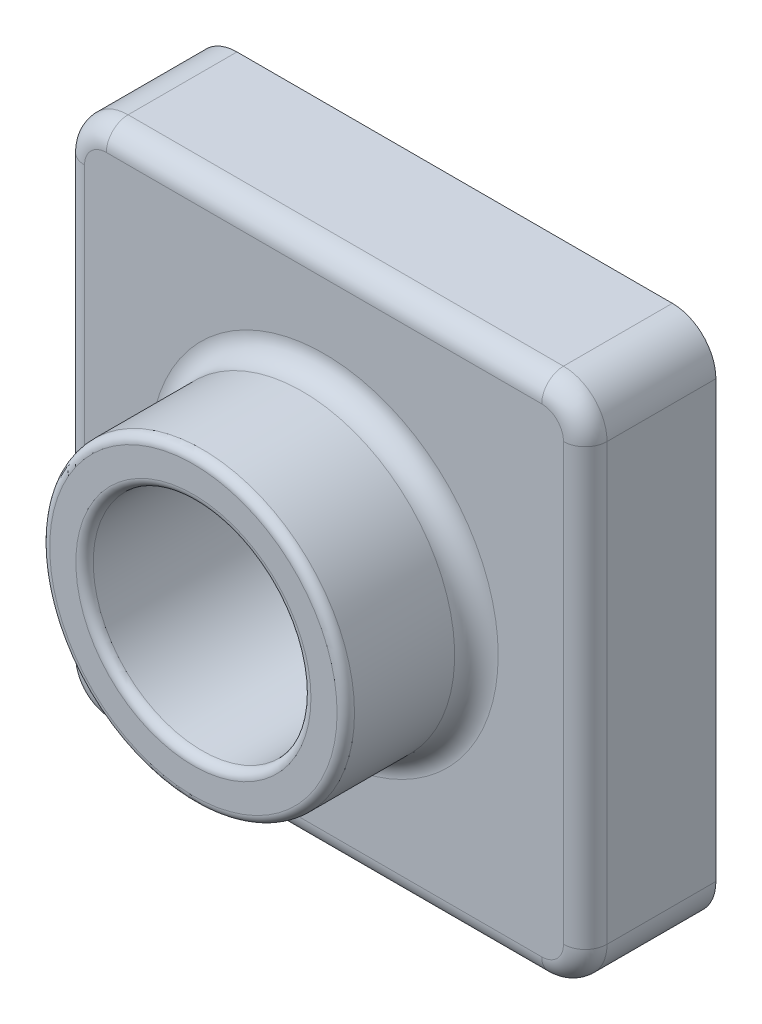
ISO-10303-21;
HEADER;
FILE_DESCRIPTION(('STEP AP214'),'2;1');
FILE_NAME('part.step','',(''),(''),'','','');
FILE_SCHEMA(('AUTOMOTIVE_DESIGN { 1 0 10303 214 1 1 1 1 }'));
ENDSEC;
DATA;
#1=APPLICATION_CONTEXT('core data for automotive mechanical design processes');
#2=APPLICATION_PROTOCOL_DEFINITION('international standard','automotive_design',2000,#1);
#3=PRODUCT_CONTEXT('',#1,'mechanical');
#4=PRODUCT('Part','Part','',(#3));
#5=PRODUCT_RELATED_PRODUCT_CATEGORY('part','',(#4));
#6=PRODUCT_DEFINITION_FORMATION('','',#4);
#7=PRODUCT_DEFINITION_CONTEXT('part definition',#1,'design');
#8=PRODUCT_DEFINITION('design','',#6,#7);
#9=PRODUCT_DEFINITION_SHAPE('','',#8);
#10=(LENGTH_UNIT() NAMED_UNIT(*) SI_UNIT(.MILLI.,.METRE.));
#11=(NAMED_UNIT(*) PLANE_ANGLE_UNIT() SI_UNIT($,.RADIAN.));
#12=(NAMED_UNIT(*) SI_UNIT($,.STERADIAN.) SOLID_ANGLE_UNIT());
#13=UNCERTAINTY_MEASURE_WITH_UNIT(LENGTH_MEASURE(1.E-05),#10,'distance_accuracy_value','');
#14=(GEOMETRIC_REPRESENTATION_CONTEXT(3) GLOBAL_UNCERTAINTY_ASSIGNED_CONTEXT((#13)) GLOBAL_UNIT_ASSIGNED_CONTEXT((#10,
#11,#12)) REPRESENTATION_CONTEXT('',''));
#15=CARTESIAN_POINT('',(0.,0.,0.));
#16=DIRECTION('',(0.,0.,1.));
#17=DIRECTION('',(1.,0.,0.));
#18=AXIS2_PLACEMENT_3D('',#15,#16,#17);
#19=CARTESIAN_POINT('',(0.,120.,0.));
#20=DIRECTION('',(0.,0.,-1.));
#21=DIRECTION('',(-1.,0.,0.));
#22=AXIS2_PLACEMENT_3D('',#19,#20,#21);
#23=PLANE('',#22);
#24=DIRECTION('',(0.,1.,0.));
#25=VECTOR('',#24,1.);
#26=CARTESIAN_POINT('',(120.,0.,0.));
#27=LINE('',#26,#25);
#28=CARTESIAN_POINT('',(120.,10.,0.));
#29=VERTEX_POINT('',#28);
#30=CARTESIAN_POINT('',(120.,110.,0.));
#31=VERTEX_POINT('',#30);
#32=EDGE_CURVE('E330',#29,#31,#27,.T.);
#33=ORIENTED_EDGE('',*,*,#32,.F.);
#34=CARTESIAN_POINT('',(110.,10.,0.));
#35=DIRECTION('',(0.,0.,-1.));
#36=DIRECTION('',(-1.,0.,0.));
#37=AXIS2_PLACEMENT_3D('',#34,#35,#36);
#38=CIRCLE('',#37,10.);
#39=CARTESIAN_POINT('',(110.,0.,0.));
#40=VERTEX_POINT('',#39);
#41=EDGE_CURVE('E359',#29,#40,#38,.T.);
#42=ORIENTED_EDGE('',*,*,#41,.T.);
#43=DIRECTION('',(1.,0.,0.));
#44=VECTOR('',#43,1.);
#45=CARTESIAN_POINT('',(0.,0.,0.));
#46=LINE('',#45,#44);
#47=CARTESIAN_POINT('',(10.,0.,0.));
#48=VERTEX_POINT('',#47);
#49=EDGE_CURVE('E327',#48,#40,#46,.T.);
#50=ORIENTED_EDGE('',*,*,#49,.F.);
#51=CARTESIAN_POINT('',(10.,10.,0.));
#52=DIRECTION('',(0.,0.,-1.));
#53=DIRECTION('',(-1.,0.,0.));
#54=AXIS2_PLACEMENT_3D('',#51,#52,#53);
#55=CIRCLE('',#54,10.);
#56=CARTESIAN_POINT('',(0.,10.,0.));
#57=VERTEX_POINT('',#56);
#58=EDGE_CURVE('E357',#48,#57,#55,.T.);
#59=ORIENTED_EDGE('',*,*,#58,.T.);
#60=DIRECTION('',(0.,-1.,0.));
#61=VECTOR('',#60,1.);
#62=CARTESIAN_POINT('',(0.,0.,0.));
#63=LINE('',#62,#61);
#64=CARTESIAN_POINT('',(0.,110.,0.));
#65=VERTEX_POINT('',#64);
#66=EDGE_CURVE('E324',#65,#57,#63,.T.);
#67=ORIENTED_EDGE('',*,*,#66,.F.);
#68=CARTESIAN_POINT('',(10.,110.,0.));
#69=DIRECTION('',(0.,0.,-1.));
#70=DIRECTION('',(-1.,0.,0.));
#71=AXIS2_PLACEMENT_3D('',#68,#69,#70);
#72=CIRCLE('',#71,10.);
#73=CARTESIAN_POINT('',(10.,120.,0.));
#74=VERTEX_POINT('',#73);
#75=EDGE_CURVE('E355',#65,#74,#72,.T.);
#76=ORIENTED_EDGE('',*,*,#75,.T.);
#77=DIRECTION('',(-1.,0.,0.));
#78=VECTOR('',#77,1.);
#79=CARTESIAN_POINT('',(0.,120.,0.));
#80=LINE('',#79,#78);
#81=CARTESIAN_POINT('',(110.,120.,0.));
#82=VERTEX_POINT('',#81);
#83=EDGE_CURVE('E333',#82,#74,#80,.T.);
#84=ORIENTED_EDGE('',*,*,#83,.F.);
#85=CARTESIAN_POINT('',(110.,110.,0.));
#86=DIRECTION('',(0.,0.,-1.));
#87=DIRECTION('',(-1.,0.,0.));
#88=AXIS2_PLACEMENT_3D('',#85,#86,#87);
#89=CIRCLE('',#88,10.);
#90=EDGE_CURVE('E353',#82,#31,#89,.T.);
#91=ORIENTED_EDGE('',*,*,#90,.T.);
#92=EDGE_LOOP('',(#33,#42,#50,#59,#67,#76,#84,#91));
#93=FACE_BOUND('',#92,.T.);
#94=CARTESIAN_POINT('',(110.,10.,0.));
#95=DIRECTION('',(0.,0.,-1.));
#96=DIRECTION('',(-1.,0.,0.));
#97=AXIS2_PLACEMENT_3D('',#94,#95,#96);
#98=CIRCLE('',#97,8.);
#99=CARTESIAN_POINT('',(118.,10.,0.));
#100=VERTEX_POINT('',#99);
#101=CARTESIAN_POINT('',(110.,2.,0.));
#102=VERTEX_POINT('',#101);
#103=EDGE_CURVE('E280',#100,#102,#98,.T.);
#104=ORIENTED_EDGE('',*,*,#103,.F.);
#105=DIRECTION('',(0.,1.,0.));
#106=VECTOR('',#105,1.);
#107=CARTESIAN_POINT('',(118.,120.,0.));
#108=LINE('',#107,#106);
#109=CARTESIAN_POINT('',(118.,110.,0.));
#110=VERTEX_POINT('',#109);
#111=EDGE_CURVE('E306',#100,#110,#108,.T.);
#112=ORIENTED_EDGE('',*,*,#111,.T.);
#113=CARTESIAN_POINT('',(110.,110.,0.));
#114=DIRECTION('',(0.,0.,-1.));
#115=DIRECTION('',(-1.,0.,0.));
#116=AXIS2_PLACEMENT_3D('',#113,#114,#115);
#117=CIRCLE('',#116,8.);
#118=CARTESIAN_POINT('',(110.,118.,0.));
#119=VERTEX_POINT('',#118);
#120=EDGE_CURVE('E269',#119,#110,#117,.T.);
#121=ORIENTED_EDGE('',*,*,#120,.F.);
#122=DIRECTION('',(-1.,0.,0.));
#123=VECTOR('',#122,1.);
#124=CARTESIAN_POINT('',(0.,118.,0.));
#125=LINE('',#124,#123);
#126=CARTESIAN_POINT('',(10.,118.,0.));
#127=VERTEX_POINT('',#126);
#128=EDGE_CURVE('E49',#119,#127,#125,.T.);
#129=ORIENTED_EDGE('',*,*,#128,.T.);
#130=CARTESIAN_POINT('',(10.,110.,0.));
#131=DIRECTION('',(0.,0.,-1.));
#132=DIRECTION('',(-1.,0.,0.));
#133=AXIS2_PLACEMENT_3D('',#130,#131,#132);
#134=CIRCLE('',#133,8.);
#135=CARTESIAN_POINT('',(2.,110.,0.));
#136=VERTEX_POINT('',#135);
#137=EDGE_CURVE('E315',#136,#127,#134,.T.);
#138=ORIENTED_EDGE('',*,*,#137,.F.);
#139=DIRECTION('',(0.,-1.,0.));
#140=VECTOR('',#139,1.);
#141=CARTESIAN_POINT('',(2.,120.,0.));
#142=LINE('',#141,#140);
#143=CARTESIAN_POINT('',(2.,10.,0.));
#144=VERTEX_POINT('',#143);
#145=EDGE_CURVE('E305',#136,#144,#142,.T.);
#146=ORIENTED_EDGE('',*,*,#145,.T.);
#147=CARTESIAN_POINT('',(10.,10.,0.));
#148=DIRECTION('',(0.,0.,-1.));
#149=DIRECTION('',(-1.,0.,0.));
#150=AXIS2_PLACEMENT_3D('',#147,#148,#149);
#151=CIRCLE('',#150,8.);
#152=CARTESIAN_POINT('',(9.99999999999999,2.,0.));
#153=VERTEX_POINT('',#152);
#154=EDGE_CURVE('E311',#153,#144,#151,.T.);
#155=ORIENTED_EDGE('',*,*,#154,.F.);
#156=DIRECTION('',(1.,0.,0.));
#157=VECTOR('',#156,1.);
#158=CARTESIAN_POINT('',(0.,2.,0.));
#159=LINE('',#158,#157);
#160=EDGE_CURVE('E309',#153,#102,#159,.T.);
#161=ORIENTED_EDGE('',*,*,#160,.T.);
#162=EDGE_LOOP('',(#104,#112,#121,#129,#138,#146,#155,#161));
#163=FACE_BOUND('',#162,.T.);
#164=ADVANCED_FACE('F32',(#93,#163),#23,.T.);
#165=CARTESIAN_POINT('',(0.,120.,30.));
#166=DIRECTION('',(0.,0.,-1.));
#167=DIRECTION('',(-1.,0.,0.));
#168=AXIS2_PLACEMENT_3D('',#165,#166,#167);
#169=PLANE('',#168);
#170=CARTESIAN_POINT('',(60.,60.,30.));
#171=DIRECTION('',(0.,0.,-1.));
#172=DIRECTION('',(-1.,0.,0.));
#173=AXIS2_PLACEMENT_3D('',#170,#171,#172);
#174=CIRCLE('',#173,40.);
#175=CARTESIAN_POINT('',(20.,60.,30.));
#176=VERTEX_POINT('',#175);
#177=EDGE_CURVE('E395',#176,#176,#174,.T.);
#178=ORIENTED_EDGE('',*,*,#177,.T.);
#179=EDGE_LOOP('',(#178));
#180=FACE_BOUND('',#179,.T.);
#181=DIRECTION('',(0.,-1.,0.));
#182=VECTOR('',#181,1.);
#183=CARTESIAN_POINT('',(5.,120.,30.));
#184=LINE('',#183,#182);
#185=CARTESIAN_POINT('',(5.,110.,30.));
#186=VERTEX_POINT('',#185);
#187=CARTESIAN_POINT('',(5.,10.,30.));
#188=VERTEX_POINT('',#187);
#189=EDGE_CURVE('E390',#186,#188,#184,.T.);
#190=ORIENTED_EDGE('',*,*,#189,.T.);
#191=CARTESIAN_POINT('',(10.,10.,30.));
#192=DIRECTION('',(0.,0.,-1.));
#193=DIRECTION('',(-1.,0.,0.));
#194=AXIS2_PLACEMENT_3D('',#191,#192,#193);
#195=CIRCLE('',#194,5.);
#196=CARTESIAN_POINT('',(10.,5.,30.));
#197=VERTEX_POINT('',#196);
#198=EDGE_CURVE('E392',#188,#197,#195,.F.);
#199=ORIENTED_EDGE('',*,*,#198,.T.);
#200=DIRECTION('',(1.,0.,0.));
#201=VECTOR('',#200,1.);
#202=CARTESIAN_POINT('',(0.,5.,30.));
#203=LINE('',#202,#201);
#204=CARTESIAN_POINT('',(110.,5.,30.));
#205=VERTEX_POINT('',#204);
#206=EDGE_CURVE('E378',#197,#205,#203,.T.);
#207=ORIENTED_EDGE('',*,*,#206,.T.);
#208=CARTESIAN_POINT('',(110.,10.,30.));
#209=DIRECTION('',(0.,0.,-1.));
#210=DIRECTION('',(-1.,0.,0.));
#211=AXIS2_PLACEMENT_3D('',#208,#209,#210);
#212=CIRCLE('',#211,5.);
#213=CARTESIAN_POINT('',(115.,10.,30.));
#214=VERTEX_POINT('',#213);
#215=EDGE_CURVE('E380',#205,#214,#212,.F.);
#216=ORIENTED_EDGE('',*,*,#215,.T.);
#217=DIRECTION('',(0.,1.,0.));
#218=VECTOR('',#217,1.);
#219=CARTESIAN_POINT('',(115.,120.,30.));
#220=LINE('',#219,#218);
#221=CARTESIAN_POINT('',(115.,110.,30.));
#222=VERTEX_POINT('',#221);
#223=EDGE_CURVE('E382',#214,#222,#220,.T.);
#224=ORIENTED_EDGE('',*,*,#223,.T.);
#225=CARTESIAN_POINT('',(110.,110.,30.));
#226=DIRECTION('',(0.,0.,-1.));
#227=DIRECTION('',(-1.,0.,0.));
#228=AXIS2_PLACEMENT_3D('',#225,#226,#227);
#229=CIRCLE('',#228,5.);
#230=CARTESIAN_POINT('',(110.,115.,30.));
#231=VERTEX_POINT('',#230);
#232=EDGE_CURVE('E384',#222,#231,#229,.F.);
#233=ORIENTED_EDGE('',*,*,#232,.T.);
#234=DIRECTION('',(-1.,0.,0.));
#235=VECTOR('',#234,1.);
#236=CARTESIAN_POINT('',(0.,115.,30.));
#237=LINE('',#236,#235);
#238=CARTESIAN_POINT('',(10.,115.,30.));
#239=VERTEX_POINT('',#238);
#240=EDGE_CURVE('E386',#231,#239,#237,.T.);
#241=ORIENTED_EDGE('',*,*,#240,.T.);
#242=CARTESIAN_POINT('',(10.,110.,30.));
#243=DIRECTION('',(0.,0.,-1.));
#244=DIRECTION('',(-1.,0.,0.));
#245=AXIS2_PLACEMENT_3D('',#242,#243,#244);
#246=CIRCLE('',#245,5.);
#247=EDGE_CURVE('E388',#239,#186,#246,.F.);
#248=ORIENTED_EDGE('',*,*,#247,.T.);
#249=EDGE_LOOP('',(#190,#199,#207,#216,#224,#233,#241,#248));
#250=FACE_BOUND('',#249,.T.);
#251=ADVANCED_FACE('F475',(#180,#250),#169,.F.);
#252=CARTESIAN_POINT('',(0.,0.,30.));
#253=DIRECTION('',(1.,0.,0.));
#254=DIRECTION('',(0.,0.,-1.));
#255=AXIS2_PLACEMENT_3D('',#252,#253,#254);
#256=PLANE('',#255);
#257=DIRECTION('',(0.,0.,-1.));
#258=VECTOR('',#257,1.);
#259=CARTESIAN_POINT('',(0.,10.,30.));
#260=LINE('',#259,#258);
#261=CARTESIAN_POINT('',(0.,10.,25.));
#262=VERTEX_POINT('',#261);
#263=EDGE_CURVE('E367',#57,#262,#260,.F.);
#264=ORIENTED_EDGE('',*,*,#263,.T.);
#265=DIRECTION('',(0.,-1.,0.));
#266=VECTOR('',#265,1.);
#267=CARTESIAN_POINT('',(0.,0.,25.));
#268=LINE('',#267,#266);
#269=CARTESIAN_POINT('',(0.,110.,25.));
#270=VERTEX_POINT('',#269);
#271=EDGE_CURVE('E401',#262,#270,#268,.F.);
#272=ORIENTED_EDGE('',*,*,#271,.T.);
#273=DIRECTION('',(0.,0.,-1.));
#274=VECTOR('',#273,1.);
#275=CARTESIAN_POINT('',(0.,110.,30.));
#276=LINE('',#275,#274);
#277=EDGE_CURVE('E365',#270,#65,#276,.T.);
#278=ORIENTED_EDGE('',*,*,#277,.T.);
#279=ORIENTED_EDGE('',*,*,#66,.T.);
#280=EDGE_LOOP('',(#264,#272,#278,#279));
#281=FACE_BOUND('',#280,.T.);
#282=ADVANCED_FACE('F514',(#281),#256,.F.);
#283=CARTESIAN_POINT('',(0.,0.,30.));
#284=DIRECTION('',(0.,1.,0.));
#285=DIRECTION('',(0.,0.,1.));
#286=AXIS2_PLACEMENT_3D('',#283,#284,#285);
#287=PLANE('',#286);
#288=DIRECTION('',(0.,0.,-1.));
#289=VECTOR('',#288,1.);
#290=CARTESIAN_POINT('',(110.,0.,30.));
#291=LINE('',#290,#289);
#292=CARTESIAN_POINT('',(110.,0.,25.));
#293=VERTEX_POINT('',#292);
#294=EDGE_CURVE('E363',#40,#293,#291,.F.);
#295=ORIENTED_EDGE('',*,*,#294,.T.);
#296=DIRECTION('',(1.,0.,0.));
#297=VECTOR('',#296,1.);
#298=CARTESIAN_POINT('',(0.,0.,25.));
#299=LINE('',#298,#297);
#300=CARTESIAN_POINT('',(10.,0.,25.));
#301=VERTEX_POINT('',#300);
#302=EDGE_CURVE('E11',#293,#301,#299,.F.);
#303=ORIENTED_EDGE('',*,*,#302,.T.);
#304=DIRECTION('',(0.,0.,-1.));
#305=VECTOR('',#304,1.);
#306=CARTESIAN_POINT('',(10.,0.,30.));
#307=LINE('',#306,#305);
#308=EDGE_CURVE('E361',#301,#48,#307,.T.);
#309=ORIENTED_EDGE('',*,*,#308,.T.);
#310=ORIENTED_EDGE('',*,*,#49,.T.);
#311=EDGE_LOOP('',(#295,#303,#309,#310));
#312=FACE_BOUND('',#311,.T.);
#313=ADVANCED_FACE('F489',(#312),#287,.F.);
#314=CARTESIAN_POINT('',(120.,0.,30.));
#315=DIRECTION('',(-1.,0.,0.));
#316=DIRECTION('',(0.,-1.,0.));
#317=AXIS2_PLACEMENT_3D('',#314,#315,#316);
#318=PLANE('',#317);
#319=DIRECTION('',(0.,0.,-1.));
#320=VECTOR('',#319,1.);
#321=CARTESIAN_POINT('',(120.,110.,30.));
#322=LINE('',#321,#320);
#323=CARTESIAN_POINT('',(120.,110.,25.));
#324=VERTEX_POINT('',#323);
#325=EDGE_CURVE('E348',#31,#324,#322,.F.);
#326=ORIENTED_EDGE('',*,*,#325,.T.);
#327=DIRECTION('',(0.,1.,0.));
#328=VECTOR('',#327,1.);
#329=CARTESIAN_POINT('',(120.,0.,25.));
#330=LINE('',#329,#328);
#331=CARTESIAN_POINT('',(120.,10.,25.));
#332=VERTEX_POINT('',#331);
#333=EDGE_CURVE('E409',#324,#332,#330,.F.);
#334=ORIENTED_EDGE('',*,*,#333,.T.);
#335=DIRECTION('',(0.,0.,-1.));
#336=VECTOR('',#335,1.);
#337=CARTESIAN_POINT('',(120.,10.,30.));
#338=LINE('',#337,#336);
#339=EDGE_CURVE('E351',#332,#29,#338,.T.);
#340=ORIENTED_EDGE('',*,*,#339,.T.);
#341=ORIENTED_EDGE('',*,*,#32,.T.);
#342=EDGE_LOOP('',(#326,#334,#340,#341));
#343=FACE_BOUND('',#342,.T.);
#344=ADVANCED_FACE('F448',(#343),#318,.F.);
#345=CARTESIAN_POINT('',(0.,120.,30.));
#346=DIRECTION('',(0.,-1.,0.));
#347=DIRECTION('',(0.,0.,-1.));
#348=AXIS2_PLACEMENT_3D('',#345,#346,#347);
#349=PLANE('',#348);
#350=DIRECTION('',(0.,0.,-1.));
#351=VECTOR('',#350,1.);
#352=CARTESIAN_POINT('',(10.,120.,30.));
#353=LINE('',#352,#351);
#354=CARTESIAN_POINT('',(10.,120.,25.));
#355=VERTEX_POINT('',#354);
#356=EDGE_CURVE('E372',#74,#355,#353,.F.);
#357=ORIENTED_EDGE('',*,*,#356,.T.);
#358=DIRECTION('',(-1.,0.,0.));
#359=VECTOR('',#358,1.);
#360=CARTESIAN_POINT('',(0.,120.,25.));
#361=LINE('',#360,#359);
#362=CARTESIAN_POINT('',(110.,120.,25.));
#363=VERTEX_POINT('',#362);
#364=EDGE_CURVE('E405',#355,#363,#361,.F.);
#365=ORIENTED_EDGE('',*,*,#364,.T.);
#366=DIRECTION('',(0.,0.,-1.));
#367=VECTOR('',#366,1.);
#368=CARTESIAN_POINT('',(110.,120.,30.));
#369=LINE('',#368,#367);
#370=EDGE_CURVE('E370',#363,#82,#369,.T.);
#371=ORIENTED_EDGE('',*,*,#370,.T.);
#372=ORIENTED_EDGE('',*,*,#83,.T.);
#373=EDGE_LOOP('',(#357,#365,#371,#372));
#374=FACE_BOUND('',#373,.T.);
#375=ADVANCED_FACE('F459',(#374),#349,.F.);
#376=CARTESIAN_POINT('',(60.,60.,0.));
#377=DIRECTION('',(0.,0.,-1.));
#378=DIRECTION('',(-1.,0.,0.));
#379=AXIS2_PLACEMENT_3D('',#376,#377,#378);
#380=CIRCLE('',#379,27.);
#381=CARTESIAN_POINT('',(33.,60.,0.));
#382=VERTEX_POINT('',#381);
#383=EDGE_CURVE('E262',#382,#382,#380,.F.);
#384=ORIENTED_EDGE('',*,*,#383,.F.);
#385=EDGE_LOOP('',(#384));
#386=FACE_BOUND('',#385,.T.);
#387=CARTESIAN_POINT('',(60.,60.,0.));
#388=DIRECTION('',(0.,0.,-1.));
#389=DIRECTION('',(-1.,0.,0.));
#390=AXIS2_PLACEMENT_3D('',#387,#388,#389);
#391=CIRCLE('',#390,25.);
#392=CARTESIAN_POINT('',(35.,60.,0.));
#393=VERTEX_POINT('',#392);
#394=EDGE_CURVE('E321',#393,#393,#391,.F.);
#395=ORIENTED_EDGE('',*,*,#394,.T.);
#396=EDGE_LOOP('',(#395));
#397=FACE_BOUND('',#396,.T.);
#398=ADVANCED_FACE('F510',(#386,#397),#23,.T.);
#399=CARTESIAN_POINT('',(60.,60.,60.));
#400=DIRECTION('',(0.,0.,-1.));
#401=DIRECTION('',(-1.,0.,0.));
#402=AXIS2_PLACEMENT_3D('',#399,#400,#401);
#403=CYLINDRICAL_SURFACE('',#402,35.);
#404=CARTESIAN_POINT('',(60.,60.,35.));
#405=DIRECTION('',(0.,0.,-1.));
#406=DIRECTION('',(-1.,0.,0.));
#407=AXIS2_PLACEMENT_3D('',#404,#405,#406);
#408=CIRCLE('',#407,35.);
#409=CARTESIAN_POINT('',(25.,60.,35.));
#410=VERTEX_POINT('',#409);
#411=EDGE_CURVE('E375',#410,#410,#408,.F.);
#412=ORIENTED_EDGE('',*,*,#411,.T.);
#413=EDGE_LOOP('',(#412));
#414=FACE_BOUND('',#413,.T.);
#415=CARTESIAN_POINT('',(60.,60.,58.));
#416=DIRECTION('',(0.,0.,1.));
#417=DIRECTION('',(1.,0.,0.));
#418=AXIS2_PLACEMENT_3D('',#415,#416,#417);
#419=CIRCLE('',#418,35.);
#420=CARTESIAN_POINT('',(95.,60.,58.));
#421=VERTEX_POINT('',#420);
#422=EDGE_CURVE('E345',#421,#421,#419,.F.);
#423=ORIENTED_EDGE('',*,*,#422,.T.);
#424=EDGE_LOOP('',(#423));
#425=FACE_BOUND('',#424,.T.);
#426=ADVANCED_FACE('F519',(#414,#425),#403,.T.);
#427=CARTESIAN_POINT('',(60.,60.,60.));
#428=DIRECTION('',(0.,0.,1.));
#429=DIRECTION('',(1.,0.,0.));
#430=AXIS2_PLACEMENT_3D('',#427,#428,#429);
#431=PLANE('',#430);
#432=CARTESIAN_POINT('',(60.,60.,60.));
#433=DIRECTION('',(0.,0.,1.));
#434=DIRECTION('',(1.,0.,0.));
#435=AXIS2_PLACEMENT_3D('',#432,#433,#434);
#436=CIRCLE('',#435,27.);
#437=CARTESIAN_POINT('',(87.,60.,60.));
#438=VERTEX_POINT('',#437);
#439=EDGE_CURVE('E342',#438,#438,#436,.F.);
#440=ORIENTED_EDGE('',*,*,#439,.T.);
#441=EDGE_LOOP('',(#440));
#442=FACE_BOUND('',#441,.T.);
#443=CARTESIAN_POINT('',(60.,60.,60.));
#444=DIRECTION('',(0.,0.,1.));
#445=DIRECTION('',(1.,0.,0.));
#446=AXIS2_PLACEMENT_3D('',#443,#444,#445);
#447=CIRCLE('',#446,33.);
#448=CARTESIAN_POINT('',(93.,60.,60.));
#449=VERTEX_POINT('',#448);
#450=EDGE_CURVE('E339',#449,#449,#447,.T.);
#451=ORIENTED_EDGE('',*,*,#450,.T.);
#452=EDGE_LOOP('',(#451));
#453=FACE_BOUND('',#452,.T.);
#454=ADVANCED_FACE('F525',(#442,#453),#431,.T.);
#455=CARTESIAN_POINT('',(60.,60.,-70.7106781186548));
#456=DIRECTION('',(0.,0.,1.));
#457=DIRECTION('',(1.,0.,0.));
#458=AXIS2_PLACEMENT_3D('',#455,#456,#457);
#459=CYLINDRICAL_SURFACE('',#458,25.);
#460=CARTESIAN_POINT('',(60.,60.,58.));
#461=DIRECTION('',(0.,0.,1.));
#462=DIRECTION('',(1.,0.,0.));
#463=AXIS2_PLACEMENT_3D('',#460,#461,#462);
#464=CIRCLE('',#463,25.);
#465=CARTESIAN_POINT('',(85.,60.,58.));
#466=VERTEX_POINT('',#465);
#467=EDGE_CURVE('E336',#466,#466,#464,.T.);
#468=ORIENTED_EDGE('',*,*,#467,.T.);
#469=EDGE_LOOP('',(#468));
#470=FACE_BOUND('',#469,.T.);
#471=ORIENTED_EDGE('',*,*,#394,.F.);
#472=EDGE_LOOP('',(#471));
#473=FACE_BOUND('',#472,.T.);
#474=ADVANCED_FACE('F532',(#470,#473),#459,.F.);
#475=CARTESIAN_POINT('',(60.,60.,58.));
#476=DIRECTION('',(0.,0.,1.));
#477=DIRECTION('',(1.,0.,0.));
#478=AXIS2_PLACEMENT_3D('',#475,#476,#477);
#479=TOROIDAL_SURFACE('',#478,27.,2.);
#480=ORIENTED_EDGE('',*,*,#439,.F.);
#481=EDGE_LOOP('',(#480));
#482=FACE_BOUND('',#481,.T.);
#483=ORIENTED_EDGE('',*,*,#467,.F.);
#484=EDGE_LOOP('',(#483));
#485=FACE_BOUND('',#484,.T.);
#486=ADVANCED_FACE('F534',(#482,#485),#479,.T.);
#487=CARTESIAN_POINT('',(60.,60.,58.));
#488=DIRECTION('',(0.,0.,1.));
#489=DIRECTION('',(1.,0.,0.));
#490=AXIS2_PLACEMENT_3D('',#487,#488,#489);
#491=TOROIDAL_SURFACE('',#490,33.,2.);
#492=ORIENTED_EDGE('',*,*,#422,.F.);
#493=EDGE_LOOP('',(#492));
#494=FACE_BOUND('',#493,.T.);
#495=ORIENTED_EDGE('',*,*,#450,.F.);
#496=EDGE_LOOP('',(#495));
#497=FACE_BOUND('',#496,.T.);
#498=ADVANCED_FACE('F541',(#494,#497),#491,.T.);
#499=CARTESIAN_POINT('',(110.,10.,30.));
#500=DIRECTION('',(0.,0.,-1.));
#501=DIRECTION('',(-1.,0.,0.));
#502=AXIS2_PLACEMENT_3D('',#499,#500,#501);
#503=CYLINDRICAL_SURFACE('',#502,10.);
#504=ORIENTED_EDGE('',*,*,#339,.F.);
#505=CARTESIAN_POINT('',(110.,10.,25.));
#506=DIRECTION('',(0.,0.,-1.));
#507=DIRECTION('',(-1.,0.,0.));
#508=AXIS2_PLACEMENT_3D('',#505,#506,#507);
#509=CIRCLE('',#508,10.);
#510=EDGE_CURVE('E41',#332,#293,#509,.T.);
#511=ORIENTED_EDGE('',*,*,#510,.T.);
#512=ORIENTED_EDGE('',*,*,#294,.F.);
#513=ORIENTED_EDGE('',*,*,#41,.F.);
#514=EDGE_LOOP('',(#504,#511,#512,#513));
#515=FACE_BOUND('',#514,.T.);
#516=ADVANCED_FACE('F870',(#515),#503,.T.);
#517=CARTESIAN_POINT('',(10.,10.,30.));
#518=DIRECTION('',(0.,0.,-1.));
#519=DIRECTION('',(-1.,0.,0.));
#520=AXIS2_PLACEMENT_3D('',#517,#518,#519);
#521=CYLINDRICAL_SURFACE('',#520,10.);
#522=ORIENTED_EDGE('',*,*,#308,.F.);
#523=CARTESIAN_POINT('',(10.,10.,25.));
#524=DIRECTION('',(0.,0.,-1.));
#525=DIRECTION('',(-1.,0.,0.));
#526=AXIS2_PLACEMENT_3D('',#523,#524,#525);
#527=CIRCLE('',#526,10.);
#528=EDGE_CURVE('E398',#301,#262,#527,.T.);
#529=ORIENTED_EDGE('',*,*,#528,.T.);
#530=ORIENTED_EDGE('',*,*,#263,.F.);
#531=ORIENTED_EDGE('',*,*,#58,.F.);
#532=EDGE_LOOP('',(#522,#529,#530,#531));
#533=FACE_BOUND('',#532,.T.);
#534=ADVANCED_FACE('F493',(#533),#521,.T.);
#535=CARTESIAN_POINT('',(10.,110.,30.));
#536=DIRECTION('',(0.,0.,-1.));
#537=DIRECTION('',(-1.,0.,0.));
#538=AXIS2_PLACEMENT_3D('',#535,#536,#537);
#539=CYLINDRICAL_SURFACE('',#538,10.);
#540=ORIENTED_EDGE('',*,*,#277,.F.);
#541=CARTESIAN_POINT('',(10.,110.,25.));
#542=DIRECTION('',(0.,0.,-1.));
#543=DIRECTION('',(-1.,0.,0.));
#544=AXIS2_PLACEMENT_3D('',#541,#542,#543);
#545=CIRCLE('',#544,10.);
#546=EDGE_CURVE('E403',#270,#355,#545,.T.);
#547=ORIENTED_EDGE('',*,*,#546,.T.);
#548=ORIENTED_EDGE('',*,*,#356,.F.);
#549=ORIENTED_EDGE('',*,*,#75,.F.);
#550=EDGE_LOOP('',(#540,#547,#548,#549));
#551=FACE_BOUND('',#550,.T.);
#552=ADVANCED_FACE('F462',(#551),#539,.T.);
#553=CARTESIAN_POINT('',(110.,110.,30.));
#554=DIRECTION('',(0.,0.,-1.));
#555=DIRECTION('',(-1.,0.,0.));
#556=AXIS2_PLACEMENT_3D('',#553,#554,#555);
#557=CYLINDRICAL_SURFACE('',#556,10.);
#558=ORIENTED_EDGE('',*,*,#370,.F.);
#559=CARTESIAN_POINT('',(110.,110.,25.));
#560=DIRECTION('',(0.,0.,-1.));
#561=DIRECTION('',(-1.,0.,0.));
#562=AXIS2_PLACEMENT_3D('',#559,#560,#561);
#563=CIRCLE('',#562,10.);
#564=EDGE_CURVE('E407',#363,#324,#563,.T.);
#565=ORIENTED_EDGE('',*,*,#564,.T.);
#566=ORIENTED_EDGE('',*,*,#325,.F.);
#567=ORIENTED_EDGE('',*,*,#90,.F.);
#568=EDGE_LOOP('',(#558,#565,#566,#567));
#569=FACE_BOUND('',#568,.T.);
#570=ADVANCED_FACE('F445',(#569),#557,.T.);
#571=CARTESIAN_POINT('',(60.,60.,35.));
#572=DIRECTION('',(0.,0.,-1.));
#573=DIRECTION('',(-1.,0.,0.));
#574=AXIS2_PLACEMENT_3D('',#571,#572,#573);
#575=TOROIDAL_SURFACE('',#574,40.,5.);
#576=ORIENTED_EDGE('',*,*,#177,.F.);
#577=EDGE_LOOP('',(#576));
#578=FACE_BOUND('',#577,.T.);
#579=ORIENTED_EDGE('',*,*,#411,.F.);
#580=EDGE_LOOP('',(#579));
#581=FACE_BOUND('',#580,.T.);
#582=ADVANCED_FACE('F841',(#578,#581),#575,.F.);
#583=CARTESIAN_POINT('',(110.,110.,25.));
#584=DIRECTION('',(0.,0.,-1.));
#585=DIRECTION('',(-1.,0.,0.));
#586=AXIS2_PLACEMENT_3D('',#583,#584,#585);
#587=DEGENERATE_TOROIDAL_SURFACE('',#586,5.,5.,.T.);
#588=CARTESIAN_POINT('',(115.,110.,25.));
#589=DIRECTION('',(0.,-1.,0.));
#590=DIRECTION('',(0.,0.,-1.));
#591=AXIS2_PLACEMENT_3D('',#588,#589,#590);
#592=CIRCLE('',#591,5.);
#593=EDGE_CURVE('E426',#324,#222,#592,.T.);
#594=ORIENTED_EDGE('',*,*,#593,.F.);
#595=ORIENTED_EDGE('',*,*,#564,.F.);
#596=CARTESIAN_POINT('',(110.,115.,25.));
#597=DIRECTION('',(-1.,0.,0.));
#598=DIRECTION('',(0.,0.,1.));
#599=AXIS2_PLACEMENT_3D('',#596,#597,#598);
#600=CIRCLE('',#599,5.);
#601=EDGE_CURVE('E36',#231,#363,#600,.T.);
#602=ORIENTED_EDGE('',*,*,#601,.F.);
#603=ORIENTED_EDGE('',*,*,#232,.F.);
#604=EDGE_LOOP('',(#594,#595,#602,#603));
#605=FACE_BOUND('',#604,.T.);
#606=ADVANCED_FACE('F34',(#605),#587,.T.);
#607=CARTESIAN_POINT('',(0.,115.,25.));
#608=DIRECTION('',(-1.,0.,0.));
#609=DIRECTION('',(0.,0.,1.));
#610=AXIS2_PLACEMENT_3D('',#607,#608,#609);
#611=CYLINDRICAL_SURFACE('',#610,5.);
#612=ORIENTED_EDGE('',*,*,#601,.T.);
#613=ORIENTED_EDGE('',*,*,#364,.F.);
#614=CARTESIAN_POINT('',(10.,115.,25.));
#615=DIRECTION('',(-1.,0.,0.));
#616=DIRECTION('',(0.,0.,1.));
#617=AXIS2_PLACEMENT_3D('',#614,#615,#616);
#618=CIRCLE('',#617,5.);
#619=EDGE_CURVE('E424',#239,#355,#618,.T.);
#620=ORIENTED_EDGE('',*,*,#619,.F.);
#621=ORIENTED_EDGE('',*,*,#240,.F.);
#622=EDGE_LOOP('',(#612,#613,#620,#621));
#623=FACE_BOUND('',#622,.T.);
#624=ADVANCED_FACE('F437',(#623),#611,.T.);
#625=CARTESIAN_POINT('',(115.,120.,25.));
#626=DIRECTION('',(0.,1.,0.));
#627=DIRECTION('',(-1.,0.,0.));
#628=AXIS2_PLACEMENT_3D('',#625,#626,#627);
#629=CYLINDRICAL_SURFACE('',#628,5.);
#630=ORIENTED_EDGE('',*,*,#593,.T.);
#631=ORIENTED_EDGE('',*,*,#223,.F.);
#632=CARTESIAN_POINT('',(115.,10.,25.));
#633=DIRECTION('',(0.,-1.,0.));
#634=DIRECTION('',(0.,0.,-1.));
#635=AXIS2_PLACEMENT_3D('',#632,#633,#634);
#636=CIRCLE('',#635,5.);
#637=EDGE_CURVE('E421',#332,#214,#636,.T.);
#638=ORIENTED_EDGE('',*,*,#637,.F.);
#639=ORIENTED_EDGE('',*,*,#333,.F.);
#640=EDGE_LOOP('',(#630,#631,#638,#639));
#641=FACE_BOUND('',#640,.T.);
#642=ADVANCED_FACE('F478',(#641),#629,.T.);
#643=CARTESIAN_POINT('',(10.,110.,25.));
#644=DIRECTION('',(0.,0.,-1.));
#645=DIRECTION('',(-1.,0.,0.));
#646=AXIS2_PLACEMENT_3D('',#643,#644,#645);
#647=DEGENERATE_TOROIDAL_SURFACE('',#646,5.,5.,.T.);
#648=ORIENTED_EDGE('',*,*,#619,.T.);
#649=ORIENTED_EDGE('',*,*,#546,.F.);
#650=CARTESIAN_POINT('',(5.,110.,25.));
#651=DIRECTION('',(0.,-1.,0.));
#652=DIRECTION('',(0.,0.,-1.));
#653=AXIS2_PLACEMENT_3D('',#650,#651,#652);
#654=CIRCLE('',#653,5.);
#655=EDGE_CURVE('E418',#186,#270,#654,.T.);
#656=ORIENTED_EDGE('',*,*,#655,.F.);
#657=ORIENTED_EDGE('',*,*,#247,.F.);
#658=EDGE_LOOP('',(#648,#649,#656,#657));
#659=FACE_BOUND('',#658,.T.);
#660=ADVANCED_FACE('F466',(#659),#647,.T.);
#661=CARTESIAN_POINT('',(110.,10.,25.));
#662=DIRECTION('',(0.,0.,-1.));
#663=DIRECTION('',(-1.,0.,0.));
#664=AXIS2_PLACEMENT_3D('',#661,#662,#663);
#665=DEGENERATE_TOROIDAL_SURFACE('',#664,5.,5.,.T.);
#666=ORIENTED_EDGE('',*,*,#637,.T.);
#667=ORIENTED_EDGE('',*,*,#215,.F.);
#668=CARTESIAN_POINT('',(110.,5.,25.));
#669=DIRECTION('',(-1.,0.,0.));
#670=DIRECTION('',(0.,0.,1.));
#671=AXIS2_PLACEMENT_3D('',#668,#669,#670);
#672=CIRCLE('',#671,5.);
#673=EDGE_CURVE('E415',#293,#205,#672,.T.);
#674=ORIENTED_EDGE('',*,*,#673,.F.);
#675=ORIENTED_EDGE('',*,*,#510,.F.);
#676=EDGE_LOOP('',(#666,#667,#674,#675));
#677=FACE_BOUND('',#676,.T.);
#678=ADVANCED_FACE('F480',(#677),#665,.T.);
#679=CARTESIAN_POINT('',(5.,120.,25.));
#680=DIRECTION('',(0.,-1.,0.));
#681=DIRECTION('',(0.,0.,-1.));
#682=AXIS2_PLACEMENT_3D('',#679,#680,#681);
#683=CYLINDRICAL_SURFACE('',#682,5.);
#684=ORIENTED_EDGE('',*,*,#655,.T.);
#685=ORIENTED_EDGE('',*,*,#271,.F.);
#686=CARTESIAN_POINT('',(5.,10.,25.));
#687=DIRECTION('',(0.,-1.,0.));
#688=DIRECTION('',(0.,0.,-1.));
#689=AXIS2_PLACEMENT_3D('',#686,#687,#688);
#690=CIRCLE('',#689,5.);
#691=EDGE_CURVE('E413',#188,#262,#690,.T.);
#692=ORIENTED_EDGE('',*,*,#691,.F.);
#693=ORIENTED_EDGE('',*,*,#189,.F.);
#694=EDGE_LOOP('',(#684,#685,#692,#693));
#695=FACE_BOUND('',#694,.T.);
#696=ADVANCED_FACE('F471',(#695),#683,.T.);
#697=CARTESIAN_POINT('',(0.,5.,25.));
#698=DIRECTION('',(1.,0.,0.));
#699=DIRECTION('',(0.,0.,-1.));
#700=AXIS2_PLACEMENT_3D('',#697,#698,#699);
#701=CYLINDRICAL_SURFACE('',#700,5.);
#702=ORIENTED_EDGE('',*,*,#673,.T.);
#703=ORIENTED_EDGE('',*,*,#206,.F.);
#704=CARTESIAN_POINT('',(10.,5.,25.));
#705=DIRECTION('',(-1.,0.,0.));
#706=DIRECTION('',(0.,0.,1.));
#707=AXIS2_PLACEMENT_3D('',#704,#705,#706);
#708=CIRCLE('',#707,5.);
#709=EDGE_CURVE('E278',#301,#197,#708,.T.);
#710=ORIENTED_EDGE('',*,*,#709,.F.);
#711=ORIENTED_EDGE('',*,*,#302,.F.);
#712=EDGE_LOOP('',(#702,#703,#710,#711));
#713=FACE_BOUND('',#712,.T.);
#714=ADVANCED_FACE('F486',(#713),#701,.T.);
#715=CARTESIAN_POINT('',(10.,10.,25.));
#716=DIRECTION('',(0.,0.,-1.));
#717=DIRECTION('',(-1.,0.,0.));
#718=AXIS2_PLACEMENT_3D('',#715,#716,#717);
#719=DEGENERATE_TOROIDAL_SURFACE('',#718,5.,5.,.T.);
#720=ORIENTED_EDGE('',*,*,#691,.T.);
#721=ORIENTED_EDGE('',*,*,#528,.F.);
#722=ORIENTED_EDGE('',*,*,#709,.T.);
#723=ORIENTED_EDGE('',*,*,#198,.F.);
#724=EDGE_LOOP('',(#720,#721,#722,#723));
#725=FACE_BOUND('',#724,.T.);
#726=ADVANCED_FACE('F496',(#725),#719,.T.);
#727=CARTESIAN_POINT('',(0.,120.,28.));
#728=DIRECTION('',(0.,0.,-1.));
#729=DIRECTION('',(-1.,0.,0.));
#730=AXIS2_PLACEMENT_3D('',#727,#728,#729);
#731=PLANE('',#730);
#732=CARTESIAN_POINT('',(60.,60.,28.));
#733=DIRECTION('',(0.,0.,-1.));
#734=DIRECTION('',(-1.,0.,0.));
#735=AXIS2_PLACEMENT_3D('',#732,#733,#734);
#736=CIRCLE('',#735,40.);
#737=CARTESIAN_POINT('',(20.,60.,28.));
#738=VERTEX_POINT('',#737);
#739=EDGE_CURVE('E225',#738,#738,#736,.T.);
#740=ORIENTED_EDGE('',*,*,#739,.F.);
#741=EDGE_LOOP('',(#740));
#742=FACE_BOUND('',#741,.T.);
#743=DIRECTION('',(0.,1.,0.));
#744=VECTOR('',#743,1.);
#745=CARTESIAN_POINT('',(5.,120.,28.));
#746=LINE('',#745,#744);
#747=CARTESIAN_POINT('',(5.,110.,28.));
#748=VERTEX_POINT('',#747);
#749=CARTESIAN_POINT('',(5.,9.99999999999999,28.));
#750=VERTEX_POINT('',#749);
#751=EDGE_CURVE('E197',#748,#750,#746,.F.);
#752=ORIENTED_EDGE('',*,*,#751,.F.);
#753=CARTESIAN_POINT('',(10.,110.,28.));
#754=DIRECTION('',(0.,0.,-1.));
#755=DIRECTION('',(-1.,0.,0.));
#756=AXIS2_PLACEMENT_3D('',#753,#754,#755);
#757=CIRCLE('',#756,5.);
#758=CARTESIAN_POINT('',(10.,115.,28.));
#759=VERTEX_POINT('',#758);
#760=EDGE_CURVE('E208',#759,#748,#757,.F.);
#761=ORIENTED_EDGE('',*,*,#760,.F.);
#762=DIRECTION('',(-1.,0.,0.));
#763=VECTOR('',#762,1.);
#764=CARTESIAN_POINT('',(0.,115.,28.));
#765=LINE('',#764,#763);
#766=CARTESIAN_POINT('',(110.,115.,28.));
#767=VERTEX_POINT('',#766);
#768=EDGE_CURVE('E238',#767,#759,#765,.T.);
#769=ORIENTED_EDGE('',*,*,#768,.F.);
#770=CARTESIAN_POINT('',(110.,110.,28.));
#771=DIRECTION('',(0.,0.,-1.));
#772=DIRECTION('',(-1.,0.,0.));
#773=AXIS2_PLACEMENT_3D('',#770,#771,#772);
#774=CIRCLE('',#773,5.);
#775=CARTESIAN_POINT('',(115.,110.,28.));
#776=VERTEX_POINT('',#775);
#777=EDGE_CURVE('E236',#776,#767,#774,.F.);
#778=ORIENTED_EDGE('',*,*,#777,.F.);
#779=DIRECTION('',(0.,1.,0.));
#780=VECTOR('',#779,1.);
#781=CARTESIAN_POINT('',(115.,120.,28.));
#782=LINE('',#781,#780);
#783=CARTESIAN_POINT('',(115.,9.99999999999999,28.));
#784=VERTEX_POINT('',#783);
#785=EDGE_CURVE('E234',#784,#776,#782,.T.);
#786=ORIENTED_EDGE('',*,*,#785,.F.);
#787=CARTESIAN_POINT('',(110.,10.,28.));
#788=DIRECTION('',(0.,0.,-1.));
#789=DIRECTION('',(-1.,0.,0.));
#790=AXIS2_PLACEMENT_3D('',#787,#788,#789);
#791=CIRCLE('',#790,5.);
#792=CARTESIAN_POINT('',(110.,5.,28.));
#793=VERTEX_POINT('',#792);
#794=EDGE_CURVE('E231',#793,#784,#791,.F.);
#795=ORIENTED_EDGE('',*,*,#794,.F.);
#796=DIRECTION('',(-1.,0.,0.));
#797=VECTOR('',#796,1.);
#798=CARTESIAN_POINT('',(0.,5.,28.));
#799=LINE('',#798,#797);
#800=CARTESIAN_POINT('',(10.,5.,28.));
#801=VERTEX_POINT('',#800);
#802=EDGE_CURVE('E224',#801,#793,#799,.F.);
#803=ORIENTED_EDGE('',*,*,#802,.F.);
#804=CARTESIAN_POINT('',(10.,10.,28.));
#805=DIRECTION('',(0.,0.,-1.));
#806=DIRECTION('',(-1.,0.,0.));
#807=AXIS2_PLACEMENT_3D('',#804,#805,#806);
#808=CIRCLE('',#807,5.);
#809=EDGE_CURVE('E207',#750,#801,#808,.F.);
#810=ORIENTED_EDGE('',*,*,#809,.F.);
#811=EDGE_LOOP('',(#752,#761,#769,#778,#786,#795,#803,#810));
#812=FACE_BOUND('',#811,.T.);
#813=ADVANCED_FACE('F222',(#742,#812),#731,.T.);
#814=CARTESIAN_POINT('',(2.,0.,30.));
#815=DIRECTION('',(1.,0.,0.));
#816=DIRECTION('',(0.,0.,-1.));
#817=AXIS2_PLACEMENT_3D('',#814,#815,#816);
#818=PLANE('',#817);
#819=DIRECTION('',(0.,0.,-1.));
#820=VECTOR('',#819,1.);
#821=CARTESIAN_POINT('',(2.,10.,30.));
#822=LINE('',#821,#820);
#823=CARTESIAN_POINT('',(2.,10.,25.));
#824=VERTEX_POINT('',#823);
#825=EDGE_CURVE('E283',#144,#824,#822,.F.);
#826=ORIENTED_EDGE('',*,*,#825,.F.);
#827=ORIENTED_EDGE('',*,*,#145,.F.);
#828=DIRECTION('',(0.,0.,-1.));
#829=VECTOR('',#828,1.);
#830=CARTESIAN_POINT('',(2.,110.,30.));
#831=LINE('',#830,#829);
#832=CARTESIAN_POINT('',(2.,110.,25.));
#833=VERTEX_POINT('',#832);
#834=EDGE_CURVE('E275',#833,#136,#831,.T.);
#835=ORIENTED_EDGE('',*,*,#834,.F.);
#836=DIRECTION('',(0.,1.,0.));
#837=VECTOR('',#836,1.);
#838=CARTESIAN_POINT('',(2.,0.,25.));
#839=LINE('',#838,#837);
#840=EDGE_CURVE('E282',#824,#833,#839,.T.);
#841=ORIENTED_EDGE('',*,*,#840,.F.);
#842=EDGE_LOOP('',(#826,#827,#835,#841));
#843=FACE_BOUND('',#842,.T.);
#844=ADVANCED_FACE('F503',(#843),#818,.T.);
#845=CARTESIAN_POINT('',(0.,2.,30.));
#846=DIRECTION('',(0.,1.,0.));
#847=DIRECTION('',(0.,0.,1.));
#848=AXIS2_PLACEMENT_3D('',#845,#846,#847);
#849=PLANE('',#848);
#850=DIRECTION('',(0.,0.,1.));
#851=VECTOR('',#850,1.);
#852=CARTESIAN_POINT('',(110.,2.,30.));
#853=LINE('',#852,#851);
#854=CARTESIAN_POINT('',(110.,2.,25.));
#855=VERTEX_POINT('',#854);
#856=EDGE_CURVE('E272',#102,#855,#853,.T.);
#857=ORIENTED_EDGE('',*,*,#856,.F.);
#858=ORIENTED_EDGE('',*,*,#160,.F.);
#859=DIRECTION('',(0.,0.,1.));
#860=VECTOR('',#859,1.);
#861=CARTESIAN_POINT('',(10.,2.,30.));
#862=LINE('',#861,#860);
#863=CARTESIAN_POINT('',(10.,2.,25.));
#864=VERTEX_POINT('',#863);
#865=EDGE_CURVE('E276',#864,#153,#862,.F.);
#866=ORIENTED_EDGE('',*,*,#865,.F.);
#867=DIRECTION('',(1.,0.,0.));
#868=VECTOR('',#867,1.);
#869=CARTESIAN_POINT('',(0.,2.,25.));
#870=LINE('',#869,#868);
#871=EDGE_CURVE('E271',#855,#864,#870,.F.);
#872=ORIENTED_EDGE('',*,*,#871,.F.);
#873=EDGE_LOOP('',(#857,#858,#866,#872));
#874=FACE_BOUND('',#873,.T.);
#875=ADVANCED_FACE('F613',(#874),#849,.T.);
#876=CARTESIAN_POINT('',(118.,0.,30.));
#877=DIRECTION('',(-1.,0.,0.));
#878=DIRECTION('',(0.,-1.,0.));
#879=AXIS2_PLACEMENT_3D('',#876,#877,#878);
#880=PLANE('',#879);
#881=DIRECTION('',(0.,0.,1.));
#882=VECTOR('',#881,1.);
#883=CARTESIAN_POINT('',(118.,110.,30.));
#884=LINE('',#883,#882);
#885=CARTESIAN_POINT('',(118.,110.,25.));
#886=VERTEX_POINT('',#885);
#887=EDGE_CURVE('E247',#110,#886,#884,.T.);
#888=ORIENTED_EDGE('',*,*,#887,.F.);
#889=ORIENTED_EDGE('',*,*,#111,.F.);
#890=DIRECTION('',(0.,0.,1.));
#891=VECTOR('',#890,1.);
#892=CARTESIAN_POINT('',(118.,10.,30.));
#893=LINE('',#892,#891);
#894=CARTESIAN_POINT('',(118.,10.,25.));
#895=VERTEX_POINT('',#894);
#896=EDGE_CURVE('E265',#895,#100,#893,.F.);
#897=ORIENTED_EDGE('',*,*,#896,.F.);
#898=DIRECTION('',(0.,-1.,0.));
#899=VECTOR('',#898,1.);
#900=CARTESIAN_POINT('',(118.,0.,25.));
#901=LINE('',#900,#899);
#902=EDGE_CURVE('E258',#886,#895,#901,.T.);
#903=ORIENTED_EDGE('',*,*,#902,.F.);
#904=EDGE_LOOP('',(#888,#889,#897,#903));
#905=FACE_BOUND('',#904,.T.);
#906=ADVANCED_FACE('F610',(#905),#880,.T.);
#907=CARTESIAN_POINT('',(0.,118.,30.));
#908=DIRECTION('',(0.,-1.,0.));
#909=DIRECTION('',(0.,0.,-1.));
#910=AXIS2_PLACEMENT_3D('',#907,#908,#909);
#911=PLANE('',#910);
#912=DIRECTION('',(0.,0.,-1.));
#913=VECTOR('',#912,1.);
#914=CARTESIAN_POINT('',(10.,118.,30.));
#915=LINE('',#914,#913);
#916=CARTESIAN_POINT('',(10.,118.,25.));
#917=VERTEX_POINT('',#916);
#918=EDGE_CURVE('E243',#127,#917,#915,.F.);
#919=ORIENTED_EDGE('',*,*,#918,.F.);
#920=ORIENTED_EDGE('',*,*,#128,.F.);
#921=DIRECTION('',(0.,0.,-1.));
#922=VECTOR('',#921,1.);
#923=CARTESIAN_POINT('',(110.,118.,30.));
#924=LINE('',#923,#922);
#925=CARTESIAN_POINT('',(110.,118.,25.));
#926=VERTEX_POINT('',#925);
#927=EDGE_CURVE('E285',#926,#119,#924,.T.);
#928=ORIENTED_EDGE('',*,*,#927,.F.);
#929=DIRECTION('',(1.,0.,0.));
#930=VECTOR('',#929,1.);
#931=CARTESIAN_POINT('',(0.,118.,25.));
#932=LINE('',#931,#930);
#933=EDGE_CURVE('E259',#917,#926,#932,.T.);
#934=ORIENTED_EDGE('',*,*,#933,.F.);
#935=EDGE_LOOP('',(#919,#920,#928,#934));
#936=FACE_BOUND('',#935,.T.);
#937=ADVANCED_FACE('F606',(#936),#911,.T.);
#938=CARTESIAN_POINT('',(60.,60.,60.));
#939=DIRECTION('',(0.,0.,-1.));
#940=DIRECTION('',(-1.,0.,0.));
#941=AXIS2_PLACEMENT_3D('',#938,#939,#940);
#942=CYLINDRICAL_SURFACE('',#941,33.);
#943=CARTESIAN_POINT('',(60.,60.,35.));
#944=DIRECTION('',(0.,0.,-1.));
#945=DIRECTION('',(-1.,0.,0.));
#946=AXIS2_PLACEMENT_3D('',#943,#944,#945);
#947=CIRCLE('',#946,33.);
#948=CARTESIAN_POINT('',(27.,60.,35.));
#949=VERTEX_POINT('',#948);
#950=EDGE_CURVE('E232',#949,#949,#947,.F.);
#951=ORIENTED_EDGE('',*,*,#950,.F.);
#952=EDGE_LOOP('',(#951));
#953=FACE_BOUND('',#952,.T.);
#954=CARTESIAN_POINT('',(60.,60.,58.));
#955=DIRECTION('',(0.,0.,1.));
#956=DIRECTION('',(1.,0.,0.));
#957=AXIS2_PLACEMENT_3D('',#954,#955,#956);
#958=CIRCLE('',#957,33.);
#959=CARTESIAN_POINT('',(93.,60.,58.));
#960=VERTEX_POINT('',#959);
#961=EDGE_CURVE('E244',#960,#960,#958,.T.);
#962=ORIENTED_EDGE('',*,*,#961,.T.);
#963=EDGE_LOOP('',(#962));
#964=FACE_BOUND('',#963,.T.);
#965=ADVANCED_FACE('F602',(#953,#964),#942,.F.);
#966=CARTESIAN_POINT('',(60.,60.,58.));
#967=DIRECTION('',(0.,0.,1.));
#968=DIRECTION('',(1.,0.,0.));
#969=AXIS2_PLACEMENT_3D('',#966,#967,#968);
#970=PLANE('',#969);
#971=CARTESIAN_POINT('',(60.,60.,58.));
#972=DIRECTION('',(0.,0.,1.));
#973=DIRECTION('',(1.,0.,0.));
#974=AXIS2_PLACEMENT_3D('',#971,#972,#973);
#975=CIRCLE('',#974,27.);
#976=CARTESIAN_POINT('',(87.,60.,58.));
#977=VERTEX_POINT('',#976);
#978=EDGE_CURVE('E248',#977,#977,#975,.T.);
#979=ORIENTED_EDGE('',*,*,#978,.T.);
#980=EDGE_LOOP('',(#979));
#981=FACE_BOUND('',#980,.T.);
#982=ORIENTED_EDGE('',*,*,#961,.F.);
#983=EDGE_LOOP('',(#982));
#984=FACE_BOUND('',#983,.T.);
#985=ADVANCED_FACE('F598',(#981,#984),#970,.F.);
#986=CARTESIAN_POINT('',(60.,60.,-70.7106781186548));
#987=DIRECTION('',(0.,0.,1.));
#988=DIRECTION('',(1.,0.,0.));
#989=AXIS2_PLACEMENT_3D('',#986,#987,#988);
#990=CYLINDRICAL_SURFACE('',#989,27.);
#991=ORIENTED_EDGE('',*,*,#978,.F.);
#992=EDGE_LOOP('',(#991));
#993=FACE_BOUND('',#992,.T.);
#994=ORIENTED_EDGE('',*,*,#383,.T.);
#995=EDGE_LOOP('',(#994));
#996=FACE_BOUND('',#995,.T.);
#997=ADVANCED_FACE('F594',(#993,#996),#990,.T.);
#998=CARTESIAN_POINT('',(110.,10.,30.));
#999=DIRECTION('',(0.,0.,-1.));
#1000=DIRECTION('',(-1.,0.,0.));
#1001=AXIS2_PLACEMENT_3D('',#998,#999,#1000);
#1002=CYLINDRICAL_SURFACE('',#1001,8.);
#1003=ORIENTED_EDGE('',*,*,#896,.T.);
#1004=ORIENTED_EDGE('',*,*,#103,.T.);
#1005=ORIENTED_EDGE('',*,*,#856,.T.);
#1006=CARTESIAN_POINT('',(110.,10.,25.));
#1007=DIRECTION('',(0.,0.,-1.));
#1008=DIRECTION('',(-1.,0.,0.));
#1009=AXIS2_PLACEMENT_3D('',#1006,#1007,#1008);
#1010=CIRCLE('',#1009,8.);
#1011=EDGE_CURVE('E267',#895,#855,#1010,.T.);
#1012=ORIENTED_EDGE('',*,*,#1011,.F.);
#1013=EDGE_LOOP('',(#1003,#1004,#1005,#1012));
#1014=FACE_BOUND('',#1013,.T.);
#1015=ADVANCED_FACE('F590',(#1014),#1002,.F.);
#1016=CARTESIAN_POINT('',(10.,10.,30.));
#1017=DIRECTION('',(0.,0.,-1.));
#1018=DIRECTION('',(-1.,0.,0.));
#1019=AXIS2_PLACEMENT_3D('',#1016,#1017,#1018);
#1020=CYLINDRICAL_SURFACE('',#1019,8.);
#1021=ORIENTED_EDGE('',*,*,#865,.T.);
#1022=ORIENTED_EDGE('',*,*,#154,.T.);
#1023=ORIENTED_EDGE('',*,*,#825,.T.);
#1024=CARTESIAN_POINT('',(10.,10.,25.));
#1025=DIRECTION('',(0.,0.,-1.));
#1026=DIRECTION('',(-1.,0.,0.));
#1027=AXIS2_PLACEMENT_3D('',#1024,#1025,#1026);
#1028=CIRCLE('',#1027,8.);
#1029=EDGE_CURVE('E216',#864,#824,#1028,.T.);
#1030=ORIENTED_EDGE('',*,*,#1029,.F.);
#1031=EDGE_LOOP('',(#1021,#1022,#1023,#1030));
#1032=FACE_BOUND('',#1031,.T.);
#1033=ADVANCED_FACE('F586',(#1032),#1020,.F.);
#1034=CARTESIAN_POINT('',(10.,110.,30.));
#1035=DIRECTION('',(0.,0.,-1.));
#1036=DIRECTION('',(-1.,0.,0.));
#1037=AXIS2_PLACEMENT_3D('',#1034,#1035,#1036);
#1038=CYLINDRICAL_SURFACE('',#1037,8.);
#1039=ORIENTED_EDGE('',*,*,#834,.T.);
#1040=ORIENTED_EDGE('',*,*,#137,.T.);
#1041=ORIENTED_EDGE('',*,*,#918,.T.);
#1042=CARTESIAN_POINT('',(10.,110.,25.));
#1043=DIRECTION('',(0.,0.,-1.));
#1044=DIRECTION('',(-1.,0.,0.));
#1045=AXIS2_PLACEMENT_3D('',#1042,#1043,#1044);
#1046=CIRCLE('',#1045,8.);
#1047=EDGE_CURVE('E287',#833,#917,#1046,.T.);
#1048=ORIENTED_EDGE('',*,*,#1047,.F.);
#1049=EDGE_LOOP('',(#1039,#1040,#1041,#1048));
#1050=FACE_BOUND('',#1049,.T.);
#1051=ADVANCED_FACE('F582',(#1050),#1038,.F.);
#1052=CARTESIAN_POINT('',(110.,110.,30.));
#1053=DIRECTION('',(0.,0.,-1.));
#1054=DIRECTION('',(-1.,0.,0.));
#1055=AXIS2_PLACEMENT_3D('',#1052,#1053,#1054);
#1056=CYLINDRICAL_SURFACE('',#1055,8.);
#1057=ORIENTED_EDGE('',*,*,#927,.T.);
#1058=ORIENTED_EDGE('',*,*,#120,.T.);
#1059=ORIENTED_EDGE('',*,*,#887,.T.);
#1060=CARTESIAN_POINT('',(110.,110.,25.));
#1061=DIRECTION('',(0.,0.,-1.));
#1062=DIRECTION('',(-1.,0.,0.));
#1063=AXIS2_PLACEMENT_3D('',#1060,#1061,#1062);
#1064=CIRCLE('',#1063,8.);
#1065=EDGE_CURVE('E256',#926,#886,#1064,.T.);
#1066=ORIENTED_EDGE('',*,*,#1065,.F.);
#1067=EDGE_LOOP('',(#1057,#1058,#1059,#1066));
#1068=FACE_BOUND('',#1067,.T.);
#1069=ADVANCED_FACE('F578',(#1068),#1056,.F.);
#1070=CARTESIAN_POINT('',(60.,60.,35.));
#1071=DIRECTION('',(0.,0.,-1.));
#1072=DIRECTION('',(-1.,0.,0.));
#1073=AXIS2_PLACEMENT_3D('',#1070,#1071,#1072);
#1074=TOROIDAL_SURFACE('',#1073,40.,7.);
#1075=ORIENTED_EDGE('',*,*,#739,.T.);
#1076=EDGE_LOOP('',(#1075));
#1077=FACE_BOUND('',#1076,.T.);
#1078=ORIENTED_EDGE('',*,*,#950,.T.);
#1079=EDGE_LOOP('',(#1078));
#1080=FACE_BOUND('',#1079,.T.);
#1081=ADVANCED_FACE('F574',(#1077,#1080),#1074,.T.);
#1082=CARTESIAN_POINT('',(110.,110.,25.));
#1083=DIRECTION('',(0.,0.,-1.));
#1084=DIRECTION('',(-1.,0.,0.));
#1085=AXIS2_PLACEMENT_3D('',#1082,#1083,#1084);
#1086=TOROIDAL_SURFACE('',#1085,5.,3.);
#1087=CARTESIAN_POINT('',(115.,110.,25.));
#1088=DIRECTION('',(0.,1.,0.));
#1089=DIRECTION('',(-1.,0.,0.));
#1090=AXIS2_PLACEMENT_3D('',#1087,#1088,#1089);
#1091=CIRCLE('',#1090,3.);
#1092=EDGE_CURVE('E251',#886,#776,#1091,.F.);
#1093=ORIENTED_EDGE('',*,*,#1092,.T.);
#1094=ORIENTED_EDGE('',*,*,#777,.T.);
#1095=CARTESIAN_POINT('',(110.,115.,25.));
#1096=DIRECTION('',(-1.,0.,0.));
#1097=DIRECTION('',(0.,0.,1.));
#1098=AXIS2_PLACEMENT_3D('',#1095,#1096,#1097);
#1099=CIRCLE('',#1098,3.);
#1100=EDGE_CURVE('E254',#767,#926,#1099,.T.);
#1101=ORIENTED_EDGE('',*,*,#1100,.T.);
#1102=ORIENTED_EDGE('',*,*,#1065,.T.);
#1103=EDGE_LOOP('',(#1093,#1094,#1101,#1102));
#1104=FACE_BOUND('',#1103,.T.);
#1105=ADVANCED_FACE('F570',(#1104),#1086,.F.);
#1106=CARTESIAN_POINT('',(0.,115.,25.));
#1107=DIRECTION('',(-1.,0.,0.));
#1108=DIRECTION('',(0.,0.,1.));
#1109=AXIS2_PLACEMENT_3D('',#1106,#1107,#1108);
#1110=CYLINDRICAL_SURFACE('',#1109,3.);
#1111=ORIENTED_EDGE('',*,*,#1100,.F.);
#1112=ORIENTED_EDGE('',*,*,#768,.T.);
#1113=CARTESIAN_POINT('',(10.,115.,25.));
#1114=DIRECTION('',(-1.,0.,0.));
#1115=DIRECTION('',(0.,-1.,0.));
#1116=AXIS2_PLACEMENT_3D('',#1113,#1114,#1115);
#1117=CIRCLE('',#1116,3.);
#1118=EDGE_CURVE('E255',#759,#917,#1117,.T.);
#1119=ORIENTED_EDGE('',*,*,#1118,.T.);
#1120=ORIENTED_EDGE('',*,*,#933,.T.);
#1121=EDGE_LOOP('',(#1111,#1112,#1119,#1120));
#1122=FACE_BOUND('',#1121,.T.);
#1123=ADVANCED_FACE('F566',(#1122),#1110,.F.);
#1124=CARTESIAN_POINT('',(115.,120.,25.));
#1125=DIRECTION('',(0.,1.,0.));
#1126=DIRECTION('',(-1.,0.,0.));
#1127=AXIS2_PLACEMENT_3D('',#1124,#1125,#1126);
#1128=CYLINDRICAL_SURFACE('',#1127,3.);
#1129=ORIENTED_EDGE('',*,*,#1092,.F.);
#1130=ORIENTED_EDGE('',*,*,#902,.T.);
#1131=CARTESIAN_POINT('',(115.,10.,25.));
#1132=DIRECTION('',(0.,1.,0.));
#1133=DIRECTION('',(-1.,0.,0.));
#1134=AXIS2_PLACEMENT_3D('',#1131,#1132,#1133);
#1135=CIRCLE('',#1134,3.);
#1136=EDGE_CURVE('E296',#895,#784,#1135,.F.);
#1137=ORIENTED_EDGE('',*,*,#1136,.T.);
#1138=ORIENTED_EDGE('',*,*,#785,.T.);
#1139=EDGE_LOOP('',(#1129,#1130,#1137,#1138));
#1140=FACE_BOUND('',#1139,.T.);
#1141=ADVANCED_FACE('F562',(#1140),#1128,.F.);
#1142=CARTESIAN_POINT('',(10.,110.,25.));
#1143=DIRECTION('',(0.,0.,-1.));
#1144=DIRECTION('',(-1.,0.,0.));
#1145=AXIS2_PLACEMENT_3D('',#1142,#1143,#1144);
#1146=TOROIDAL_SURFACE('',#1145,5.,3.);
#1147=ORIENTED_EDGE('',*,*,#1118,.F.);
#1148=ORIENTED_EDGE('',*,*,#760,.T.);
#1149=CARTESIAN_POINT('',(5.,110.,25.));
#1150=DIRECTION('',(0.,-1.,0.));
#1151=DIRECTION('',(0.,0.,-1.));
#1152=AXIS2_PLACEMENT_3D('',#1149,#1150,#1151);
#1153=CIRCLE('',#1152,3.);
#1154=EDGE_CURVE('E203',#748,#833,#1153,.T.);
#1155=ORIENTED_EDGE('',*,*,#1154,.T.);
#1156=ORIENTED_EDGE('',*,*,#1047,.T.);
#1157=EDGE_LOOP('',(#1147,#1148,#1155,#1156));
#1158=FACE_BOUND('',#1157,.T.);
#1159=ADVANCED_FACE('F558',(#1158),#1146,.F.);
#1160=CARTESIAN_POINT('',(110.,10.,25.));
#1161=DIRECTION('',(0.,0.,-1.));
#1162=DIRECTION('',(-1.,0.,0.));
#1163=AXIS2_PLACEMENT_3D('',#1160,#1161,#1162);
#1164=TOROIDAL_SURFACE('',#1163,5.,3.);
#1165=ORIENTED_EDGE('',*,*,#1136,.F.);
#1166=ORIENTED_EDGE('',*,*,#1011,.T.);
#1167=CARTESIAN_POINT('',(110.,5.,25.));
#1168=DIRECTION('',(1.,0.,0.));
#1169=DIRECTION('',(0.,0.,-1.));
#1170=AXIS2_PLACEMENT_3D('',#1167,#1168,#1169);
#1171=CIRCLE('',#1170,3.);
#1172=EDGE_CURVE('E218',#855,#793,#1171,.F.);
#1173=ORIENTED_EDGE('',*,*,#1172,.T.);
#1174=ORIENTED_EDGE('',*,*,#794,.T.);
#1175=EDGE_LOOP('',(#1165,#1166,#1173,#1174));
#1176=FACE_BOUND('',#1175,.T.);
#1177=ADVANCED_FACE('F555',(#1176),#1164,.F.);
#1178=CARTESIAN_POINT('',(5.,120.,25.));
#1179=DIRECTION('',(0.,-1.,0.));
#1180=DIRECTION('',(0.,0.,-1.));
#1181=AXIS2_PLACEMENT_3D('',#1178,#1179,#1180);
#1182=CYLINDRICAL_SURFACE('',#1181,3.);
#1183=ORIENTED_EDGE('',*,*,#1154,.F.);
#1184=ORIENTED_EDGE('',*,*,#751,.T.);
#1185=CARTESIAN_POINT('',(5.,10.,25.));
#1186=DIRECTION('',(0.,-1.,0.));
#1187=DIRECTION('',(0.,0.,-1.));
#1188=AXIS2_PLACEMENT_3D('',#1185,#1186,#1187);
#1189=CIRCLE('',#1188,3.);
#1190=EDGE_CURVE('E200',#750,#824,#1189,.T.);
#1191=ORIENTED_EDGE('',*,*,#1190,.T.);
#1192=ORIENTED_EDGE('',*,*,#840,.T.);
#1193=EDGE_LOOP('',(#1183,#1184,#1191,#1192));
#1194=FACE_BOUND('',#1193,.T.);
#1195=ADVANCED_FACE('F199',(#1194),#1182,.F.);
#1196=CARTESIAN_POINT('',(0.,5.,25.));
#1197=DIRECTION('',(1.,0.,0.));
#1198=DIRECTION('',(0.,0.,-1.));
#1199=AXIS2_PLACEMENT_3D('',#1196,#1197,#1198);
#1200=CYLINDRICAL_SURFACE('',#1199,3.);
#1201=ORIENTED_EDGE('',*,*,#1172,.F.);
#1202=ORIENTED_EDGE('',*,*,#871,.T.);
#1203=CARTESIAN_POINT('',(10.,5.,25.));
#1204=DIRECTION('',(1.,0.,0.));
#1205=DIRECTION('',(0.,1.,0.));
#1206=AXIS2_PLACEMENT_3D('',#1203,#1204,#1205);
#1207=CIRCLE('',#1206,3.);
#1208=EDGE_CURVE('E219',#864,#801,#1207,.F.);
#1209=ORIENTED_EDGE('',*,*,#1208,.T.);
#1210=ORIENTED_EDGE('',*,*,#802,.T.);
#1211=EDGE_LOOP('',(#1201,#1202,#1209,#1210));
#1212=FACE_BOUND('',#1211,.T.);
#1213=ADVANCED_FACE('F549',(#1212),#1200,.F.);
#1214=CARTESIAN_POINT('',(10.,10.,25.));
#1215=DIRECTION('',(0.,0.,-1.));
#1216=DIRECTION('',(-1.,0.,0.));
#1217=AXIS2_PLACEMENT_3D('',#1214,#1215,#1216);
#1218=TOROIDAL_SURFACE('',#1217,5.,3.);
#1219=ORIENTED_EDGE('',*,*,#1190,.F.);
#1220=ORIENTED_EDGE('',*,*,#809,.T.);
#1221=ORIENTED_EDGE('',*,*,#1208,.F.);
#1222=ORIENTED_EDGE('',*,*,#1029,.T.);
#1223=EDGE_LOOP('',(#1219,#1220,#1221,#1222));
#1224=FACE_BOUND('',#1223,.T.);
#1225=ADVANCED_FACE('F213',(#1224),#1218,.F.);
#1226=CLOSED_SHELL('',(#164,#251,#282,#313,#344,#375,#398,#426,#454,#474,#486,#498,#516,#534,
#552,#570,#582,#606,#624,#642,#660,#678,#696,#714,#726,#813,#844,#875,#906,#937,#965,#985,#997,
#1015,#1033,#1051,#1069,#1081,#1105,#1123,#1141,#1159,#1177,#1195,#1213,#1225));
#1227=MANIFOLD_SOLID_BREP('B2',#1226);
#1228=ADVANCED_BREP_SHAPE_REPRESENTATION('',(#18,#1227),#14);
#1229=SHAPE_DEFINITION_REPRESENTATION(#9,#1228);
ENDSEC;
END-ISO-10303-21;
